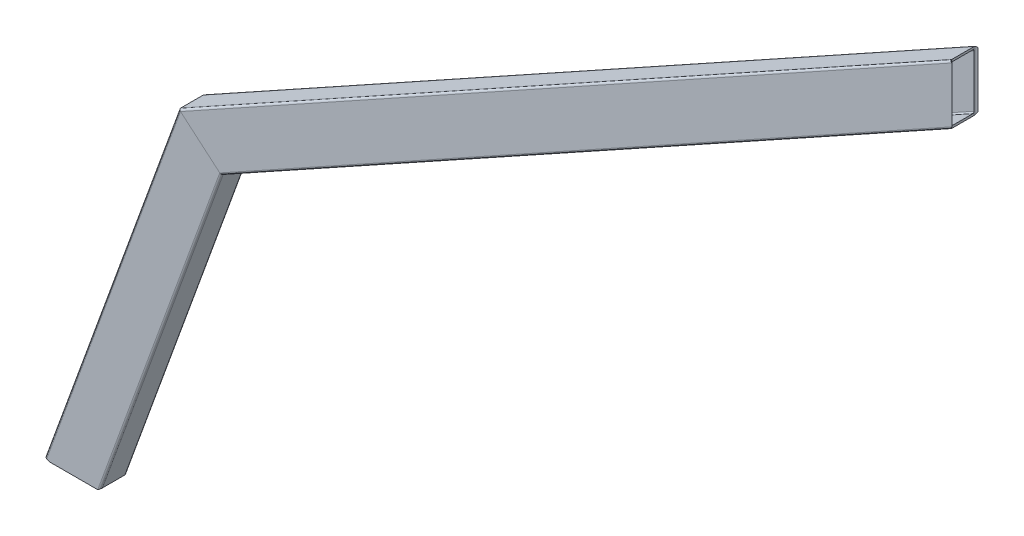
ISO-10303-21;
HEADER;
FILE_DESCRIPTION(('STEP AP214'),'2;1');
FILE_NAME('part.step','',(''),(''),'','','');
FILE_SCHEMA(('AUTOMOTIVE_DESIGN { 1 0 10303 214 1 1 1 1 }'));
ENDSEC;
DATA;
#1=APPLICATION_CONTEXT('core data for automotive mechanical design processes');
#2=APPLICATION_PROTOCOL_DEFINITION('international standard','automotive_design',2000,#1);
#3=PRODUCT_CONTEXT('',#1,'mechanical');
#4=PRODUCT('Part','Part','',(#3));
#5=PRODUCT_RELATED_PRODUCT_CATEGORY('part','',(#4));
#6=PRODUCT_DEFINITION_FORMATION('','',#4);
#7=PRODUCT_DEFINITION_CONTEXT('part definition',#1,'design');
#8=PRODUCT_DEFINITION('design','',#6,#7);
#9=PRODUCT_DEFINITION_SHAPE('','',#8);
#10=(LENGTH_UNIT() NAMED_UNIT(*) SI_UNIT(.MILLI.,.METRE.));
#11=(NAMED_UNIT(*) PLANE_ANGLE_UNIT() SI_UNIT($,.RADIAN.));
#12=(NAMED_UNIT(*) SI_UNIT($,.STERADIAN.) SOLID_ANGLE_UNIT());
#13=UNCERTAINTY_MEASURE_WITH_UNIT(LENGTH_MEASURE(1.E-05),#10,'distance_accuracy_value','');
#14=(GEOMETRIC_REPRESENTATION_CONTEXT(3) GLOBAL_UNCERTAINTY_ASSIGNED_CONTEXT((#13)) GLOBAL_UNIT_ASSIGNED_CONTEXT((#10,
#11,#12)) REPRESENTATION_CONTEXT('',''));
#15=CARTESIAN_POINT('',(0.,0.,0.));
#16=DIRECTION('',(0.,0.,1.));
#17=DIRECTION('',(1.,0.,0.));
#18=AXIS2_PLACEMENT_3D('',#15,#16,#17);
#19=CARTESIAN_POINT('',(-570.728079304435,246.926707300552,-17.0000000000489));
#20=DIRECTION('',(0.48497687865495,-0.874526973380525,0.));
#21=DIRECTION('',(0.874526973380525,0.48497687865495,0.));
#22=AXIS2_PLACEMENT_3D('',#19,#20,#21);
#23=PLANE('',#22);
#24=DIRECTION('',(0.874526973380525,0.48497687865495,0.));
#25=VECTOR('',#24,1.);
#26=CARTESIAN_POINT('',(-570.728079304435,246.926707300552,-17.0000000000489));
#27=LINE('',#26,#25);
#28=CARTESIAN_POINT('',(-557.653002268671,254.177610065125,-17.0000000000489));
#29=VERTEX_POINT('',#28);
#30=CARTESIAN_POINT('',(1.11022302462516E-13,563.429149062703,-16.9999999999999));
#31=VERTEX_POINT('',#30);
#32=EDGE_CURVE('E215',#29,#31,#27,.T.);
#33=ORIENTED_EDGE('',*,*,#32,.T.);
#34=DIRECTION('',(0.,0.,1.));
#35=VECTOR('',#34,1.);
#36=CARTESIAN_POINT('',(1.11022302462516E-13,563.429149062703,-17.0000000000489));
#37=LINE('',#36,#35);
#38=CARTESIAN_POINT('',(1.11022302462516E-13,563.429149062703,0.));
#39=VERTEX_POINT('',#38);
#40=EDGE_CURVE('E206',#31,#39,#37,.T.);
#41=ORIENTED_EDGE('',*,*,#40,.T.);
#42=DIRECTION('',(0.874526973380525,0.48497687865495,0.));
#43=VECTOR('',#42,1.);
#44=CARTESIAN_POINT('',(-570.728079304435,246.926707300552,-4.89608353859694E-11));
#45=LINE('',#44,#43);
#46=CARTESIAN_POINT('',(-557.653002268671,254.177610065125,-4.89608353859694E-11));
#47=VERTEX_POINT('',#46);
#48=EDGE_CURVE('E243',#47,#39,#45,.T.);
#49=ORIENTED_EDGE('',*,*,#48,.F.);
#50=DIRECTION('',(0.,0.,1.));
#51=VECTOR('',#50,1.);
#52=CARTESIAN_POINT('',(-557.653002268671,254.177610065125,-17.0000000000489));
#53=LINE('',#52,#51);
#54=EDGE_CURVE('E238',#29,#47,#53,.T.);
#55=ORIENTED_EDGE('',*,*,#54,.F.);
#56=EDGE_LOOP('',(#33,#41,#49,#55));
#57=FACE_BOUND('',#56,.T.);
#58=ADVANCED_FACE('F34',(#57),#23,.T.);
#59=CARTESIAN_POINT('',(-571.455544622418,248.238497760623,-17.0000000000489));
#60=DIRECTION('',(0.874526973380525,0.48497687865495,0.));
#61=DIRECTION('',(-0.48497687865495,0.874526973380525,0.));
#62=AXIS2_PLACEMENT_3D('',#59,#60,#61);
#63=CYLINDRICAL_SURFACE('',#62,1.50000000000002);
#64=DIRECTION('',(0.874526973380525,0.48497687865495,0.));
#65=VECTOR('',#64,1.);
#66=CARTESIAN_POINT('',(-571.455544622418,248.238497760623,-18.5000000000489));
#67=LINE('',#66,#65);
#68=CARTESIAN_POINT('',(-558.870782975494,255.217491671524,-18.5000000000489));
#69=VERTEX_POINT('',#68);
#70=CARTESIAN_POINT('',(1.50000000000017,565.976200652629,-18.4999999999999));
#71=VERTEX_POINT('',#70);
#72=EDGE_CURVE('E214',#69,#71,#67,.T.);
#73=ORIENTED_EDGE('',*,*,#72,.T.);
#74=CARTESIAN_POINT('',(1.50000000000017,565.976200652629,-17.0000000000244));
#75=DIRECTION('',(0.861677688772011,-0.507455969195875,0.));
#76=DIRECTION('',(0.507455969195875,0.861677688772011,0.));
#77=AXIS2_PLACEMENT_3D('',#74,#75,#76);
#78=ELLIPSE('',#77,2.95592148098473,1.50000000000001);
#79=EDGE_CURVE('E220',#71,#31,#78,.F.);
#80=ORIENTED_EDGE('',*,*,#79,.T.);
#81=ORIENTED_EDGE('',*,*,#32,.F.);
#82=CARTESIAN_POINT('',(-558.870782975494,255.217491671524,-17.0000000000489));
#83=DIRECTION('',(0.649375333167932,0.760468064203249,0.));
#84=DIRECTION('',(-0.760468064203249,0.649375333167932,0.));
#85=AXIS2_PLACEMENT_3D('',#82,#83,#84);
#86=ELLIPSE('',#85,1.60135680135299,1.50000000000002);
#87=EDGE_CURVE('E354',#69,#29,#86,.F.);
#88=ORIENTED_EDGE('',*,*,#87,.F.);
#89=EDGE_LOOP('',(#73,#80,#81,#88));
#90=FACE_BOUND('',#89,.T.);
#91=ADVANCED_FACE('F230',(#90),#63,.T.);
#92=CARTESIAN_POINT('',(-589.399689132651,280.595995775702,-17.0000000000489));
#93=DIRECTION('',(0.874526973380525,0.48497687865495,0.));
#94=DIRECTION('',(-0.48497687865495,0.874526973380525,0.));
#95=AXIS2_PLACEMENT_3D('',#92,#93,#94);
#96=CYLINDRICAL_SURFACE('',#95,1.50000000000002);
#97=DIRECTION('',(0.874526973380525,0.48497687865495,0.));
#98=VECTOR('',#97,1.);
#99=CARTESIAN_POINT('',(-590.127154450633,281.907786235773,-17.0000000000489));
#100=LINE('',#99,#98);
#101=CARTESIAN_POINT('',(-590.127154450633,281.907786235773,-17.0000000000489));
#102=VERTEX_POINT('',#101);
#103=CARTESIAN_POINT('',(1.11022302462516E-13,609.168161371698,-16.9999999999999));
#104=VERTEX_POINT('',#103);
#105=EDGE_CURVE('E234',#102,#104,#100,.T.);
#106=ORIENTED_EDGE('',*,*,#105,.T.);
#107=CARTESIAN_POINT('',(1.50000000000017,608.28478703845,-17.0000000000244));
#108=DIRECTION('',(0.507455969195875,0.861677688772011,0.));
#109=DIRECTION('',(0.861677688772011,-0.507455969195875,0.));
#110=AXIS2_PLACEMENT_3D('',#107,#108,#109);
#111=ELLIPSE('',#110,1.74079011159925,1.50000000000001);
#112=CARTESIAN_POINT('',(1.50000000000017,608.28478703845,-18.4999999999999));
#113=VERTEX_POINT('',#112);
#114=EDGE_CURVE('E251',#104,#113,#111,.F.);
#115=ORIENTED_EDGE('',*,*,#114,.T.);
#116=DIRECTION('',(0.874526973380525,0.48497687865495,0.));
#117=VECTOR('',#116,1.);
#118=CARTESIAN_POINT('',(-589.399689132651,280.595995775702,-18.5000000000489));
#119=LINE('',#118,#117);
#120=CARTESIAN_POINT('',(-588.90937374381,280.867904629374,-18.5000000000489));
#121=VERTEX_POINT('',#120);
#122=EDGE_CURVE('E291',#121,#113,#119,.T.);
#123=ORIENTED_EDGE('',*,*,#122,.F.);
#124=CARTESIAN_POINT('',(-588.90937374381,280.867904629374,-17.0000000000489));
#125=DIRECTION('',(0.649375333167932,0.760468064203249,0.));
#126=DIRECTION('',(-0.760468064203249,0.649375333167932,0.));
#127=AXIS2_PLACEMENT_3D('',#124,#125,#126);
#128=ELLIPSE('',#127,1.60135680135298,1.50000000000002);
#129=EDGE_CURVE('E359',#102,#121,#128,.F.);
#130=ORIENTED_EDGE('',*,*,#129,.F.);
#131=EDGE_LOOP('',(#106,#115,#123,#130));
#132=FACE_BOUND('',#131,.T.);
#133=ADVANCED_FACE('F414',(#132),#96,.T.);
#134=CARTESIAN_POINT('',(-590.127154450633,281.907786235773,-17.0000000000489));
#135=DIRECTION('',(-0.48497687865495,0.874526973380525,0.));
#136=DIRECTION('',(-0.874526973380525,-0.48497687865495,0.));
#137=AXIS2_PLACEMENT_3D('',#134,#135,#136);
#138=PLANE('',#137);
#139=DIRECTION('',(0.874526973380525,0.48497687865495,0.));
#140=VECTOR('',#139,1.);
#141=CARTESIAN_POINT('',(-590.127154450633,281.907786235773,-4.89608353859694E-11));
#142=LINE('',#141,#140);
#143=CARTESIAN_POINT('',(-590.127154450633,281.907786235773,-4.89608353859694E-11));
#144=VERTEX_POINT('',#143);
#145=CARTESIAN_POINT('',(1.11022302462516E-13,609.168161371698,1.11022302462516E-13));
#146=VERTEX_POINT('',#145);
#147=EDGE_CURVE('E253',#144,#146,#142,.T.);
#148=ORIENTED_EDGE('',*,*,#147,.T.);
#149=DIRECTION('',(0.,0.,-1.));
#150=VECTOR('',#149,1.);
#151=CARTESIAN_POINT('',(1.11022302462516E-13,609.168161371698,-17.0000000000489));
#152=LINE('',#151,#150);
#153=EDGE_CURVE('E50',#146,#104,#152,.T.);
#154=ORIENTED_EDGE('',*,*,#153,.T.);
#155=ORIENTED_EDGE('',*,*,#105,.F.);
#156=DIRECTION('',(0.,0.,1.));
#157=VECTOR('',#156,1.);
#158=CARTESIAN_POINT('',(-590.127154450633,281.907786235773,-17.0000000000489));
#159=LINE('',#158,#157);
#160=EDGE_CURVE('E256',#102,#144,#159,.T.);
#161=ORIENTED_EDGE('',*,*,#160,.T.);
#162=EDGE_LOOP('',(#148,#154,#155,#161));
#163=FACE_BOUND('',#162,.T.);
#164=ADVANCED_FACE('F438',(#163),#138,.T.);
#165=CARTESIAN_POINT('',(-589.399689132651,280.595995775702,-4.89053242347381E-11));
#166=DIRECTION('',(0.874526973380525,0.48497687865495,0.));
#167=DIRECTION('',(-0.48497687865495,0.874526973380525,0.));
#168=AXIS2_PLACEMENT_3D('',#165,#166,#167);
#169=CYLINDRICAL_SURFACE('',#168,1.50000000000002);
#170=DIRECTION('',(0.874526973380525,0.48497687865495,0.));
#171=VECTOR('',#170,1.);
#172=CARTESIAN_POINT('',(-589.399689132651,280.595995775702,1.4999999999511));
#173=LINE('',#172,#171);
#174=CARTESIAN_POINT('',(-588.90937374381,280.867904629374,1.4999999999511));
#175=VERTEX_POINT('',#174);
#176=CARTESIAN_POINT('',(1.50000000000017,608.28478703845,1.50000000000011));
#177=VERTEX_POINT('',#176);
#178=EDGE_CURVE('E282',#175,#177,#173,.T.);
#179=ORIENTED_EDGE('',*,*,#178,.T.);
#180=CARTESIAN_POINT('',(1.50000000000017,608.28478703845,-2.44249065417534E-11));
#181=DIRECTION('',(0.507455969195875,0.861677688772011,0.));
#182=DIRECTION('',(0.861677688772011,-0.507455969195875,0.));
#183=AXIS2_PLACEMENT_3D('',#180,#181,#182);
#184=ELLIPSE('',#183,1.74079011159925,1.50000000000001);
#185=EDGE_CURVE('E279',#177,#146,#184,.F.);
#186=ORIENTED_EDGE('',*,*,#185,.T.);
#187=ORIENTED_EDGE('',*,*,#147,.F.);
#188=CARTESIAN_POINT('',(-588.90937374381,280.867904629374,-4.89053242347381E-11));
#189=DIRECTION('',(0.649375333167932,0.760468064203249,0.));
#190=DIRECTION('',(-0.760468064203249,0.649375333167932,0.));
#191=AXIS2_PLACEMENT_3D('',#188,#189,#190);
#192=ELLIPSE('',#191,1.60135680135298,1.50000000000002);
#193=EDGE_CURVE('E368',#175,#144,#192,.F.);
#194=ORIENTED_EDGE('',*,*,#193,.F.);
#195=EDGE_LOOP('',(#179,#186,#187,#194));
#196=FACE_BOUND('',#195,.T.);
#197=ADVANCED_FACE('F440',(#196),#169,.T.);
#198=CARTESIAN_POINT('',(-571.455544622418,248.238497760623,1.4999999999511));
#199=DIRECTION('',(0.,0.,1.));
#200=DIRECTION('',(0.,-1.,0.));
#201=AXIS2_PLACEMENT_3D('',#198,#199,#200);
#202=PLANE('',#201);
#203=DIRECTION('',(0.874526973380525,0.48497687865495,0.));
#204=VECTOR('',#203,1.);
#205=CARTESIAN_POINT('',(-571.455544622418,248.238497760623,1.4999999999511));
#206=LINE('',#205,#204);
#207=CARTESIAN_POINT('',(-558.870782975494,255.217491671524,1.4999999999511));
#208=VERTEX_POINT('',#207);
#209=CARTESIAN_POINT('',(1.50000000000006,565.976200652629,1.4999999999511));
#210=VERTEX_POINT('',#209);
#211=EDGE_CURVE('E246',#208,#210,#206,.T.);
#212=ORIENTED_EDGE('',*,*,#211,.T.);
#213=DIRECTION('',(0.,-1.,0.));
#214=VECTOR('',#213,1.);
#215=CARTESIAN_POINT('',(1.50000000000017,862.501,1.50000000000017));
#216=LINE('',#215,#214);
#217=EDGE_CURVE('E285',#177,#210,#216,.T.);
#218=ORIENTED_EDGE('',*,*,#217,.F.);
#219=ORIENTED_EDGE('',*,*,#178,.F.);
#220=DIRECTION('',(-0.760468064203249,0.649375333167932,0.));
#221=VECTOR('',#220,1.);
#222=CARTESIAN_POINT('',(-482.826242078167,190.281892919535,1.4999999999511));
#223=LINE('',#222,#221);
#224=EDGE_CURVE('E389',#208,#175,#223,.T.);
#225=ORIENTED_EDGE('',*,*,#224,.F.);
#226=EDGE_LOOP('',(#212,#218,#219,#225));
#227=FACE_BOUND('',#226,.T.);
#228=ADVANCED_FACE('F581',(#227),#202,.T.);
#229=CARTESIAN_POINT('',(-571.455544622418,248.238497760623,-4.89053242347381E-11));
#230=DIRECTION('',(0.874526973380525,0.48497687865495,0.));
#231=DIRECTION('',(-0.48497687865495,0.874526973380525,0.));
#232=AXIS2_PLACEMENT_3D('',#229,#230,#231);
#233=CYLINDRICAL_SURFACE('',#232,1.50000000000002);
#234=ORIENTED_EDGE('',*,*,#48,.T.);
#235=CARTESIAN_POINT('',(1.50000000000017,565.976200652629,-2.44249065417534E-11));
#236=DIRECTION('',(0.861677688772011,-0.507455969195875,0.));
#237=DIRECTION('',(0.507455969195875,0.861677688772011,0.));
#238=AXIS2_PLACEMENT_3D('',#235,#236,#237);
#239=ELLIPSE('',#238,2.95592148098472,1.50000000000001);
#240=EDGE_CURVE('E245',#39,#210,#239,.F.);
#241=ORIENTED_EDGE('',*,*,#240,.T.);
#242=ORIENTED_EDGE('',*,*,#211,.F.);
#243=CARTESIAN_POINT('',(-558.870782975494,255.217491671524,-4.89053242347381E-11));
#244=DIRECTION('',(0.649375333167932,0.760468064203249,0.));
#245=DIRECTION('',(-0.760468064203249,0.649375333167932,0.));
#246=AXIS2_PLACEMENT_3D('',#243,#244,#245);
#247=ELLIPSE('',#246,1.60135680135298,1.50000000000002);
#248=EDGE_CURVE('E339',#47,#208,#247,.F.);
#249=ORIENTED_EDGE('',*,*,#248,.F.);
#250=EDGE_LOOP('',(#234,#241,#242,#249));
#251=FACE_BOUND('',#250,.T.);
#252=ADVANCED_FACE('F586',(#251),#233,.T.);
#253=CARTESIAN_POINT('',(-588.914712253996,279.721468802322,-1.00000000004891));
#254=DIRECTION('',(0.874526973380525,0.48497687865495,0.));
#255=DIRECTION('',(-0.48497687865495,0.874526973380525,0.));
#256=AXIS2_PLACEMENT_3D('',#253,#254,#255);
#257=CYLINDRICAL_SURFACE('',#256,0.999999999999976);
#258=DIRECTION('',(0.874526973380525,0.48497687865495,0.));
#259=VECTOR('',#258,1.);
#260=CARTESIAN_POINT('',(-589.399689132651,280.595995775702,-1.00000000004891));
#261=LINE('',#260,#259);
#262=CARTESIAN_POINT('',(-588.90937374381,280.867904629374,-1.00000000004891));
#263=VERTEX_POINT('',#262);
#264=CARTESIAN_POINT('',(1.11022302462516E-13,607.452948410111,-1.00000000004891));
#265=VERTEX_POINT('',#264);
#266=EDGE_CURVE('E261',#263,#265,#261,.T.);
#267=ORIENTED_EDGE('',*,*,#266,.T.);
#268=CARTESIAN_POINT('',(1.11022302462516E-13,606.309473102386,-1.00000000004891));
#269=DIRECTION('',(1.,0.,0.));
#270=DIRECTION('',(0.,1.,0.));
#271=AXIS2_PLACEMENT_3D('',#268,#269,#270);
#272=ELLIPSE('',#271,1.14347530772485,0.999999999999976);
#273=CARTESIAN_POINT('',(1.11022302462516E-13,606.309473102386,1.11022302462516E-13));
#274=VERTEX_POINT('',#273);
#275=EDGE_CURVE('E257',#265,#274,#272,.T.);
#276=ORIENTED_EDGE('',*,*,#275,.T.);
#277=DIRECTION('',(0.874526973380525,0.48497687865495,0.));
#278=VECTOR('',#277,1.);
#279=CARTESIAN_POINT('',(-588.914712253996,279.721468802322,-4.89053242347381E-11));
#280=LINE('',#279,#278);
#281=CARTESIAN_POINT('',(-588.097519939261,280.174650225108,-4.89053242347381E-11));
#282=VERTEX_POINT('',#281);
#283=EDGE_CURVE('E278',#282,#274,#280,.T.);
#284=ORIENTED_EDGE('',*,*,#283,.F.);
#285=CARTESIAN_POINT('',(-588.097519939261,280.174650225108,-1.00000000004891));
#286=DIRECTION('',(0.649375333167932,0.760468064203249,0.));
#287=DIRECTION('',(-0.760468064203249,0.649375333167932,0.));
#288=AXIS2_PLACEMENT_3D('',#285,#286,#287);
#289=ELLIPSE('',#288,1.06757120090195,0.999999999999976);
#290=EDGE_CURVE('E336',#263,#282,#289,.T.);
#291=ORIENTED_EDGE('',*,*,#290,.F.);
#292=EDGE_LOOP('',(#267,#276,#284,#291));
#293=FACE_BOUND('',#292,.T.);
#294=ADVANCED_FACE('F526',(#293),#257,.F.);
#295=CARTESIAN_POINT('',(-589.399689132651,280.595995775702,-16.0000000000489));
#296=DIRECTION('',(0.48497687865495,-0.874526973380525,0.));
#297=DIRECTION('',(0.874526973380525,0.48497687865495,0.));
#298=AXIS2_PLACEMENT_3D('',#295,#296,#297);
#299=PLANE('',#298);
#300=DIRECTION('',(0.874526973380525,0.48497687865495,0.));
#301=VECTOR('',#300,1.);
#302=CARTESIAN_POINT('',(-589.399689132651,280.595995775702,-16.0000000000489));
#303=LINE('',#302,#301);
#304=CARTESIAN_POINT('',(-588.90937374381,280.867904629374,-16.0000000000489));
#305=VERTEX_POINT('',#304);
#306=CARTESIAN_POINT('',(1.11022302462516E-13,607.452948410111,-16.0000000000489));
#307=VERTEX_POINT('',#306);
#308=EDGE_CURVE('E260',#305,#307,#303,.T.);
#309=ORIENTED_EDGE('',*,*,#308,.T.);
#310=DIRECTION('',(0.,0.,1.));
#311=VECTOR('',#310,1.);
#312=CARTESIAN_POINT('',(1.11022302462516E-13,607.452948410111,-16.0000000000489));
#313=LINE('',#312,#311);
#314=EDGE_CURVE('E262',#307,#265,#313,.T.);
#315=ORIENTED_EDGE('',*,*,#314,.T.);
#316=ORIENTED_EDGE('',*,*,#266,.F.);
#317=DIRECTION('',(0.,0.,1.));
#318=VECTOR('',#317,1.);
#319=CARTESIAN_POINT('',(-588.90937374381,280.867904629374,-16.0000000000489));
#320=LINE('',#319,#318);
#321=EDGE_CURVE('E337',#305,#263,#320,.T.);
#322=ORIENTED_EDGE('',*,*,#321,.F.);
#323=EDGE_LOOP('',(#309,#315,#316,#322));
#324=FACE_BOUND('',#323,.T.);
#325=ADVANCED_FACE('F540',(#324),#299,.T.);
#326=CARTESIAN_POINT('',(-588.914712253996,279.721468802322,-16.0000000000489));
#327=DIRECTION('',(0.874526973380525,0.48497687865495,0.));
#328=DIRECTION('',(-0.48497687865495,0.874526973380525,0.));
#329=AXIS2_PLACEMENT_3D('',#326,#327,#328);
#330=CYLINDRICAL_SURFACE('',#329,0.999999999999973);
#331=DIRECTION('',(0.874526973380525,0.48497687865495,0.));
#332=VECTOR('',#331,1.);
#333=CARTESIAN_POINT('',(-588.914712253996,279.721468802322,-17.0000000000489));
#334=LINE('',#333,#332);
#335=CARTESIAN_POINT('',(-588.097519939261,280.174650225108,-17.0000000000489));
#336=VERTEX_POINT('',#335);
#337=CARTESIAN_POINT('',(1.11022302462516E-13,606.309473102386,-16.9999999999999));
#338=VERTEX_POINT('',#337);
#339=EDGE_CURVE('E265',#336,#338,#334,.T.);
#340=ORIENTED_EDGE('',*,*,#339,.T.);
#341=CARTESIAN_POINT('',(1.11022302462516E-13,606.309473102386,-16.0000000000489));
#342=DIRECTION('',(1.,0.,0.));
#343=DIRECTION('',(0.,1.,0.));
#344=AXIS2_PLACEMENT_3D('',#341,#342,#343);
#345=ELLIPSE('',#344,1.14347530772484,0.999999999999973);
#346=EDGE_CURVE('E57',#338,#307,#345,.T.);
#347=ORIENTED_EDGE('',*,*,#346,.T.);
#348=ORIENTED_EDGE('',*,*,#308,.F.);
#349=CARTESIAN_POINT('',(-588.097519939261,280.174650225108,-16.0000000000489));
#350=DIRECTION('',(0.649375333167932,0.760468064203249,0.));
#351=DIRECTION('',(-0.760468064203249,0.649375333167932,0.));
#352=AXIS2_PLACEMENT_3D('',#349,#350,#351);
#353=ELLIPSE('',#352,1.06757120090195,0.999999999999973);
#354=EDGE_CURVE('E342',#336,#305,#353,.T.);
#355=ORIENTED_EDGE('',*,*,#354,.F.);
#356=EDGE_LOOP('',(#340,#347,#348,#355));
#357=FACE_BOUND('',#356,.T.);
#358=ADVANCED_FACE('F543',(#357),#330,.F.);
#359=CARTESIAN_POINT('',(-571.940521501073,249.113024734003,-17.0000000000489));
#360=DIRECTION('',(0.,0.,1.));
#361=DIRECTION('',(0.,-1.,0.));
#362=AXIS2_PLACEMENT_3D('',#359,#360,#361);
#363=PLANE('',#362);
#364=DIRECTION('',(0.874526973380525,0.48497687865495,0.));
#365=VECTOR('',#364,1.);
#366=CARTESIAN_POINT('',(-571.940521501073,249.113024734003,-17.0000000000489));
#367=LINE('',#366,#365);
#368=CARTESIAN_POINT('',(-559.682636780043,255.91074607579,-17.0000000000489));
#369=VERTEX_POINT('',#368);
#370=CARTESIAN_POINT('',(1.11022302462516E-13,566.287837332015,-17.0000000000489));
#371=VERTEX_POINT('',#370);
#372=EDGE_CURVE('E267',#369,#371,#367,.T.);
#373=ORIENTED_EDGE('',*,*,#372,.T.);
#374=DIRECTION('',(0.,-1.,0.));
#375=VECTOR('',#374,1.);
#376=CARTESIAN_POINT('',(1.11022302462516E-13,862.501,-16.9999999999998));
#377=LINE('',#376,#375);
#378=EDGE_CURVE('E223',#338,#371,#377,.T.);
#379=ORIENTED_EDGE('',*,*,#378,.F.);
#380=ORIENTED_EDGE('',*,*,#339,.F.);
#381=DIRECTION('',(-0.760468064203249,0.649375333167932,0.));
#382=VECTOR('',#381,1.);
#383=CARTESIAN_POINT('',(-483.538576827888,190.890166477888,-17.0000000000489));
#384=LINE('',#383,#382);
#385=EDGE_CURVE('E292',#369,#336,#384,.T.);
#386=ORIENTED_EDGE('',*,*,#385,.F.);
#387=EDGE_LOOP('',(#373,#379,#380,#386));
#388=FACE_BOUND('',#387,.T.);
#389=ADVANCED_FACE('F555',(#388),#363,.T.);
#390=CARTESIAN_POINT('',(-571.940521501073,249.113024734003,-16.0000000000489));
#391=DIRECTION('',(0.874526973380525,0.48497687865495,0.));
#392=DIRECTION('',(-0.48497687865495,0.874526973380525,0.));
#393=AXIS2_PLACEMENT_3D('',#390,#391,#392);
#394=CYLINDRICAL_SURFACE('',#393,1.00000000000003);
#395=DIRECTION('',(0.874526973380525,0.48497687865495,0.));
#396=VECTOR('',#395,1.);
#397=CARTESIAN_POINT('',(-571.455544622418,248.238497760623,-16.0000000000489));
#398=LINE('',#397,#396);
#399=CARTESIAN_POINT('',(-558.870782975494,255.217491671524,-16.0000000000489));
#400=VERTEX_POINT('',#399);
#401=CARTESIAN_POINT('',(1.11022302462516E-13,565.14436202429,-16.0000000000489));
#402=VERTEX_POINT('',#401);
#403=EDGE_CURVE('E271',#400,#402,#398,.T.);
#404=ORIENTED_EDGE('',*,*,#403,.T.);
#405=CARTESIAN_POINT('',(1.11022302462516E-13,566.287837332015,-16.0000000000489));
#406=DIRECTION('',(1.,0.,0.));
#407=DIRECTION('',(0.,1.,0.));
#408=AXIS2_PLACEMENT_3D('',#405,#406,#407);
#409=ELLIPSE('',#408,1.14347530772491,1.00000000000003);
#410=EDGE_CURVE('E268',#402,#371,#409,.T.);
#411=ORIENTED_EDGE('',*,*,#410,.T.);
#412=ORIENTED_EDGE('',*,*,#372,.F.);
#413=CARTESIAN_POINT('',(-559.682636780043,255.91074607579,-16.0000000000489));
#414=DIRECTION('',(0.649375333167932,0.760468064203249,0.));
#415=DIRECTION('',(-0.760468064203249,0.649375333167932,0.));
#416=AXIS2_PLACEMENT_3D('',#413,#414,#415);
#417=ELLIPSE('',#416,1.06757120090201,1.00000000000003);
#418=EDGE_CURVE('E345',#400,#369,#417,.T.);
#419=ORIENTED_EDGE('',*,*,#418,.F.);
#420=EDGE_LOOP('',(#404,#411,#412,#419));
#421=FACE_BOUND('',#420,.T.);
#422=ADVANCED_FACE('F557',(#421),#394,.F.);
#423=CARTESIAN_POINT('',(-571.455544622418,248.238497760623,-16.0000000000489));
#424=DIRECTION('',(-0.48497687865495,0.874526973380525,0.));
#425=DIRECTION('',(-0.874526973380525,-0.48497687865495,0.));
#426=AXIS2_PLACEMENT_3D('',#423,#424,#425);
#427=PLANE('',#426);
#428=DIRECTION('',(0.874526973380525,0.48497687865495,0.));
#429=VECTOR('',#428,1.);
#430=CARTESIAN_POINT('',(-571.455544622418,248.238497760623,-1.00000000004891));
#431=LINE('',#430,#429);
#432=CARTESIAN_POINT('',(-558.870782975494,255.217491671524,-1.00000000004891));
#433=VERTEX_POINT('',#432);
#434=CARTESIAN_POINT('',(1.11022302462516E-13,565.14436202429,-1.00000000004891));
#435=VERTEX_POINT('',#434);
#436=EDGE_CURVE('E270',#433,#435,#431,.T.);
#437=ORIENTED_EDGE('',*,*,#436,.T.);
#438=DIRECTION('',(0.,0.,-1.));
#439=VECTOR('',#438,1.);
#440=CARTESIAN_POINT('',(1.11022302462516E-13,565.14436202429,-16.0000000000489));
#441=LINE('',#440,#439);
#442=EDGE_CURVE('E272',#435,#402,#441,.T.);
#443=ORIENTED_EDGE('',*,*,#442,.T.);
#444=ORIENTED_EDGE('',*,*,#403,.F.);
#445=DIRECTION('',(0.,0.,-1.));
#446=VECTOR('',#445,1.);
#447=CARTESIAN_POINT('',(-558.870782975494,255.217491671524,-16.0000000000489));
#448=LINE('',#447,#446);
#449=EDGE_CURVE('E309',#433,#400,#448,.T.);
#450=ORIENTED_EDGE('',*,*,#449,.F.);
#451=EDGE_LOOP('',(#437,#443,#444,#450));
#452=FACE_BOUND('',#451,.T.);
#453=ADVANCED_FACE('F306',(#452),#427,.T.);
#454=CARTESIAN_POINT('',(-571.940521501073,249.113024734003,-1.00000000004891));
#455=DIRECTION('',(0.874526973380525,0.48497687865495,0.));
#456=DIRECTION('',(-0.48497687865495,0.874526973380525,0.));
#457=AXIS2_PLACEMENT_3D('',#454,#455,#456);
#458=CYLINDRICAL_SURFACE('',#457,1.00000000000003);
#459=DIRECTION('',(0.874526973380525,0.48497687865495,0.));
#460=VECTOR('',#459,1.);
#461=CARTESIAN_POINT('',(-571.940521501073,249.113024734003,-4.89053242347381E-11));
#462=LINE('',#461,#460);
#463=CARTESIAN_POINT('',(-559.682636780043,255.91074607579,-4.89053242347381E-11));
#464=VERTEX_POINT('',#463);
#465=CARTESIAN_POINT('',(2.22044604925031E-13,566.287837332015,-4.89053242347381E-11));
#466=VERTEX_POINT('',#465);
#467=EDGE_CURVE('E37',#464,#466,#462,.T.);
#468=ORIENTED_EDGE('',*,*,#467,.T.);
#469=CARTESIAN_POINT('',(1.11022302462516E-13,566.287837332015,-1.00000000004891));
#470=DIRECTION('',(1.,0.,0.));
#471=DIRECTION('',(0.,1.,0.));
#472=AXIS2_PLACEMENT_3D('',#469,#470,#471);
#473=ELLIPSE('',#472,1.14347530772491,1.00000000000003);
#474=EDGE_CURVE('E275',#466,#435,#473,.T.);
#475=ORIENTED_EDGE('',*,*,#474,.T.);
#476=ORIENTED_EDGE('',*,*,#436,.F.);
#477=CARTESIAN_POINT('',(-559.682636780043,255.91074607579,-1.00000000004891));
#478=DIRECTION('',(0.649375333167932,0.760468064203249,0.));
#479=DIRECTION('',(-0.760468064203249,0.649375333167932,0.));
#480=AXIS2_PLACEMENT_3D('',#477,#478,#479);
#481=ELLIPSE('',#480,1.06757120090201,1.00000000000003);
#482=EDGE_CURVE('E315',#464,#433,#481,.T.);
#483=ORIENTED_EDGE('',*,*,#482,.F.);
#484=EDGE_LOOP('',(#468,#475,#476,#483));
#485=FACE_BOUND('',#484,.T.);
#486=ADVANCED_FACE('F314',(#485),#458,.F.);
#487=CARTESIAN_POINT('',(-571.940521501073,249.113024734003,-4.89053242347381E-11));
#488=DIRECTION('',(0.,0.,-1.));
#489=DIRECTION('',(0.,1.,0.));
#490=AXIS2_PLACEMENT_3D('',#487,#488,#489);
#491=PLANE('',#490);
#492=ORIENTED_EDGE('',*,*,#283,.T.);
#493=DIRECTION('',(0.,-1.,0.));
#494=VECTOR('',#493,1.);
#495=CARTESIAN_POINT('',(1.11022302462516E-13,862.501,-4.89053242347381E-11));
#496=LINE('',#495,#494);
#497=EDGE_CURVE('E82',#274,#466,#496,.T.);
#498=ORIENTED_EDGE('',*,*,#497,.T.);
#499=ORIENTED_EDGE('',*,*,#467,.F.);
#500=DIRECTION('',(0.760468064203249,-0.649375333167932,0.));
#501=VECTOR('',#500,1.);
#502=CARTESIAN_POINT('',(-483.538576827888,190.890166477888,-4.89053242347381E-11));
#503=LINE('',#502,#501);
#504=EDGE_CURVE('E326',#282,#464,#503,.T.);
#505=ORIENTED_EDGE('',*,*,#504,.F.);
#506=EDGE_LOOP('',(#492,#498,#499,#505));
#507=FACE_BOUND('',#506,.T.);
#508=ADVANCED_FACE('F521',(#507),#491,.T.);
#509=CARTESIAN_POINT('',(-656.555031548075,-13.1677755180381,1.4999999999511));
#510=DIRECTION('',(0.,0.,1.));
#511=DIRECTION('',(1.,0.,0.));
#512=AXIS2_PLACEMENT_3D('',#509,#510,#511);
#513=PLANE('',#512);
#514=DIRECTION('',(0.93969262078591,-0.342020143325663,0.));
#515=VECTOR('',#514,1.);
#516=CARTESIAN_POINT('',(-656.555031548075,-13.1677755180381,1.4999999999511));
#517=LINE('',#516,#515);
#518=CARTESIAN_POINT('',(-691.323658517153,-0.513030214988539,1.4999999999511));
#519=VERTEX_POINT('',#518);
#520=CARTESIAN_POINT('',(-688.61198131915,-1.50000000000004,1.49999999995104));
#521=VERTEX_POINT('',#520);
#522=EDGE_CURVE('E369',#519,#521,#517,.T.);
#523=ORIENTED_EDGE('',*,*,#522,.T.);
#524=DIRECTION('',(1.,0.,0.));
#525=VECTOR('',#524,1.);
#526=CARTESIAN_POINT('',(-692.733197448332,-1.50000000000004,1.49999999995104));
#527=LINE('',#526,#525);
#528=CARTESIAN_POINT('',(-652.308308559409,-1.50000000000004,1.49999999995104));
#529=VERTEX_POINT('',#528);
#530=EDGE_CURVE('E372',#521,#529,#527,.T.);
#531=ORIENTED_EDGE('',*,*,#530,.T.);
#532=DIRECTION('',(0.342020143325663,0.93969262078591,0.));
#533=VECTOR('',#532,1.);
#534=CARTESIAN_POINT('',(-656.555031548075,-13.1677755180381,1.4999999999511));
#535=LINE('',#534,#533);
#536=EDGE_CURVE('E393',#529,#208,#535,.T.);
#537=ORIENTED_EDGE('',*,*,#536,.T.);
#538=ORIENTED_EDGE('',*,*,#224,.T.);
#539=DIRECTION('',(0.342020143325663,0.93969262078591,0.));
#540=VECTOR('',#539,1.);
#541=CARTESIAN_POINT('',(-691.323658517153,-0.513030214988539,1.4999999999511));
#542=LINE('',#541,#540);
#543=EDGE_CURVE('E358',#519,#175,#542,.T.);
#544=ORIENTED_EDGE('',*,*,#543,.F.);
#545=EDGE_LOOP('',(#523,#531,#537,#538,#544));
#546=FACE_BOUND('',#545,.T.);
#547=ADVANCED_FACE('F448',(#546),#513,.T.);
#548=CARTESIAN_POINT('',(-656.555031548075,-13.1677755180381,-4.89053242347381E-11));
#549=DIRECTION('',(-0.342020143325663,-0.93969262078591,0.));
#550=DIRECTION('',(0.93969262078591,-0.342020143325663,0.));
#551=AXIS2_PLACEMENT_3D('',#548,#549,#550);
#552=PLANE('',#551);
#553=CARTESIAN_POINT('',(-688.61198131915,-1.50000000000004,-17.000000000049));
#554=DIRECTION('',(-0.342020143325663,-0.93969262078591,0.));
#555=DIRECTION('',(0.93969262078591,-0.342020143325663,0.));
#556=AXIS2_PLACEMENT_3D('',#553,#554,#555);
#557=ELLIPSE('',#556,4.38570660024471,1.5);
#558=CARTESIAN_POINT('',(-692.733197448332,0.,-17.000000000049));
#559=VERTEX_POINT('',#558);
#560=CARTESIAN_POINT('',(-688.61198131915,-1.50000000000003,-18.500000000049));
#561=VERTEX_POINT('',#560);
#562=EDGE_CURVE('E430',#559,#561,#557,.T.);
#563=ORIENTED_EDGE('',*,*,#562,.F.);
#564=CARTESIAN_POINT('',(-691.323658517153,-0.513030214988539,-17.0000000000489));
#565=DIRECTION('',(0.342020143325663,0.93969262078591,0.));
#566=DIRECTION('',(-0.93969262078591,0.342020143325663,0.));
#567=AXIS2_PLACEMENT_3D('',#564,#565,#566);
#568=CIRCLE('',#567,1.50000000000002);
#569=CARTESIAN_POINT('',(-691.323658517153,-0.513030214988539,-18.5000000000489));
#570=VERTEX_POINT('',#569);
#571=EDGE_CURVE('E355',#570,#559,#568,.T.);
#572=ORIENTED_EDGE('',*,*,#571,.F.);
#573=DIRECTION('',(-0.93969262078591,0.342020143325663,0.));
#574=VECTOR('',#573,1.);
#575=CARTESIAN_POINT('',(-656.555031548075,-13.1677755180381,-18.5000000000489));
#576=LINE('',#575,#574);
#577=EDGE_CURVE('E351',#561,#570,#576,.T.);
#578=ORIENTED_EDGE('',*,*,#577,.F.);
#579=EDGE_LOOP('',(#563,#572,#578));
#580=FACE_BOUND('',#579,.T.);
#581=ADVANCED_FACE('F429',(#580),#552,.T.);
#582=CARTESIAN_POINT('',(-657.494724168861,-12.8257553747124,-17.0000000000489));
#583=DIRECTION('',(0.,0.,1.));
#584=DIRECTION('',(1.,0.,0.));
#585=AXIS2_PLACEMENT_3D('',#582,#583,#584);
#586=PLANE('',#585);
#587=DIRECTION('',(1.,0.,0.));
#588=VECTOR('',#587,1.);
#589=CARTESIAN_POINT('',(-692.733197448332,0.,-17.000000000049));
#590=LINE('',#589,#588);
#591=CARTESIAN_POINT('',(-690.072753017143,0.,-17.0000000000489));
#592=VERTEX_POINT('',#591);
#593=CARTESIAN_POINT('',(-652.826530980486,0.,-17.000000000049));
#594=VERTEX_POINT('',#593);
#595=EDGE_CURVE('E392',#592,#594,#590,.T.);
#596=ORIENTED_EDGE('',*,*,#595,.T.);
#597=DIRECTION('',(0.342020143325663,0.93969262078591,0.));
#598=VECTOR('',#597,1.);
#599=CARTESIAN_POINT('',(-657.494724168861,-12.8257553747124,-17.0000000000489));
#600=LINE('',#599,#598);
#601=EDGE_CURVE('E477',#594,#369,#600,.T.);
#602=ORIENTED_EDGE('',*,*,#601,.T.);
#603=ORIENTED_EDGE('',*,*,#385,.T.);
#604=DIRECTION('',(0.342020143325663,0.93969262078591,0.));
#605=VECTOR('',#604,1.);
#606=CARTESIAN_POINT('',(-690.383965896367,-0.855050358314194,-17.0000000000489));
#607=LINE('',#606,#605);
#608=EDGE_CURVE('E343',#592,#336,#607,.T.);
#609=ORIENTED_EDGE('',*,*,#608,.F.);
#610=EDGE_LOOP('',(#596,#602,#603,#609));
#611=FACE_BOUND('',#610,.T.);
#612=ADVANCED_FACE('F551',(#611),#586,.T.);
#613=CARTESIAN_POINT('',(-571.455544622418,248.238497760623,-18.5000000000489));
#614=DIRECTION('',(0.,0.,-1.));
#615=DIRECTION('',(0.,1.,0.));
#616=AXIS2_PLACEMENT_3D('',#613,#614,#615);
#617=PLANE('',#616);
#618=DIRECTION('',(0.,-1.,0.));
#619=VECTOR('',#618,1.);
#620=CARTESIAN_POINT('',(1.50000000000017,862.501,-18.4999999999999));
#621=LINE('',#620,#619);
#622=EDGE_CURVE('E289',#113,#71,#621,.T.);
#623=ORIENTED_EDGE('',*,*,#622,.T.);
#624=ORIENTED_EDGE('',*,*,#72,.F.);
#625=DIRECTION('',(0.760468064203249,-0.649375333167932,0.));
#626=VECTOR('',#625,1.);
#627=CARTESIAN_POINT('',(-482.826242078167,190.281892919535,-18.5000000000489));
#628=LINE('',#627,#626);
#629=EDGE_CURVE('E379',#121,#69,#628,.T.);
#630=ORIENTED_EDGE('',*,*,#629,.F.);
#631=ORIENTED_EDGE('',*,*,#122,.T.);
#632=EDGE_LOOP('',(#623,#624,#630,#631));
#633=FACE_BOUND('',#632,.T.);
#634=ADVANCED_FACE('F412',(#633),#617,.T.);
#635=CARTESIAN_POINT('',(-692.733197448332,0.,-17.0000000000489));
#636=DIRECTION('',(-0.93969262078591,0.342020143325663,0.));
#637=DIRECTION('',(-0.342020143325663,-0.93969262078591,0.));
#638=AXIS2_PLACEMENT_3D('',#635,#636,#637);
#639=PLANE('',#638);
#640=DIRECTION('',(0.342020143325663,0.93969262078591,0.));
#641=VECTOR('',#640,1.);
#642=CARTESIAN_POINT('',(-692.733197448332,0.,-4.89608353859694E-11));
#643=LINE('',#642,#641);
#644=CARTESIAN_POINT('',(-692.733197448332,0.,-4.89608353859694E-11));
#645=VERTEX_POINT('',#644);
#646=EDGE_CURVE('E364',#645,#144,#643,.T.);
#647=ORIENTED_EDGE('',*,*,#646,.T.);
#648=ORIENTED_EDGE('',*,*,#160,.F.);
#649=DIRECTION('',(0.342020143325663,0.93969262078591,0.));
#650=VECTOR('',#649,1.);
#651=CARTESIAN_POINT('',(-692.733197448332,0.,-17.0000000000489));
#652=LINE('',#651,#650);
#653=EDGE_CURVE('E376',#559,#102,#652,.T.);
#654=ORIENTED_EDGE('',*,*,#653,.F.);
#655=DIRECTION('',(0.,0.,1.));
#656=VECTOR('',#655,1.);
#657=CARTESIAN_POINT('',(-692.733197448332,0.,-17.0000000000489));
#658=LINE('',#657,#656);
#659=EDGE_CURVE('E360',#559,#645,#658,.T.);
#660=ORIENTED_EDGE('',*,*,#659,.T.);
#661=EDGE_LOOP('',(#647,#648,#654,#660));
#662=FACE_BOUND('',#661,.T.);
#663=ADVANCED_FACE('F433',(#662),#639,.T.);
#664=CARTESIAN_POINT('',(-655.145492616896,-13.6808057330266,-17.0000000000489));
#665=DIRECTION('',(0.93969262078591,-0.342020143325663,0.));
#666=DIRECTION('',(0.342020143325663,0.93969262078591,0.));
#667=AXIS2_PLACEMENT_3D('',#664,#665,#666);
#668=PLANE('',#667);
#669=DIRECTION('',(0.,0.,1.));
#670=VECTOR('',#669,1.);
#671=CARTESIAN_POINT('',(-650.166086549296,0.,-17.0000000000489));
#672=LINE('',#671,#670);
#673=CARTESIAN_POINT('',(-650.166086549296,0.,-17.000000000049));
#674=VERTEX_POINT('',#673);
#675=CARTESIAN_POINT('',(-650.166086549296,0.,-4.89608353859694E-11));
#676=VERTEX_POINT('',#675);
#677=EDGE_CURVE('E466',#674,#676,#672,.T.);
#678=ORIENTED_EDGE('',*,*,#677,.F.);
#679=DIRECTION('',(0.342020143325663,0.93969262078591,0.));
#680=VECTOR('',#679,1.);
#681=CARTESIAN_POINT('',(-655.145492616896,-13.6808057330266,-17.0000000000489));
#682=LINE('',#681,#680);
#683=EDGE_CURVE('E363',#674,#29,#682,.T.);
#684=ORIENTED_EDGE('',*,*,#683,.T.);
#685=ORIENTED_EDGE('',*,*,#54,.T.);
#686=DIRECTION('',(0.342020143325663,0.93969262078591,0.));
#687=VECTOR('',#686,1.);
#688=CARTESIAN_POINT('',(-655.145492616896,-13.6808057330266,-4.89608353859694E-11));
#689=LINE('',#688,#687);
#690=EDGE_CURVE('E367',#676,#47,#689,.T.);
#691=ORIENTED_EDGE('',*,*,#690,.F.);
#692=EDGE_LOOP('',(#678,#684,#685,#691));
#693=FACE_BOUND('',#692,.T.);
#694=ADVANCED_FACE('F517',(#693),#668,.T.);
#695=CARTESIAN_POINT('',(-656.555031548075,-13.1677755180381,-17.0000000000489));
#696=DIRECTION('',(0.342020143325663,0.93969262078591,0.));
#697=DIRECTION('',(-0.93969262078591,0.342020143325663,0.));
#698=AXIS2_PLACEMENT_3D('',#695,#696,#697);
#699=CYLINDRICAL_SURFACE('',#698,1.50000000000002);
#700=CARTESIAN_POINT('',(-652.308308559409,-1.50000000000004,-17.0000000000489));
#701=DIRECTION('',(-0.573576436351048,0.81915204428899,0.));
#702=DIRECTION('',(0.81915204428899,0.573576436351049,0.));
#703=AXIS2_PLACEMENT_3D('',#700,#701,#702);
#704=ELLIPSE('',#703,2.61517019343166,1.50000000000001);
#705=CARTESIAN_POINT('',(-652.308308559409,-1.50000000000004,-18.500000000049));
#706=VERTEX_POINT('',#705);
#707=EDGE_CURVE('E470',#706,#674,#704,.F.);
#708=ORIENTED_EDGE('',*,*,#707,.F.);
#709=DIRECTION('',(0.342020143325663,0.93969262078591,0.));
#710=VECTOR('',#709,1.);
#711=CARTESIAN_POINT('',(-656.555031548075,-13.1677755180381,-18.5000000000489));
#712=LINE('',#711,#710);
#713=EDGE_CURVE('E385',#706,#69,#712,.T.);
#714=ORIENTED_EDGE('',*,*,#713,.T.);
#715=ORIENTED_EDGE('',*,*,#87,.T.);
#716=ORIENTED_EDGE('',*,*,#683,.F.);
#717=EDGE_LOOP('',(#708,#714,#715,#716));
#718=FACE_BOUND('',#717,.T.);
#719=ADVANCED_FACE('F626',(#718),#699,.T.);
#720=CARTESIAN_POINT('',(-656.555031548075,-13.1677755180381,-18.5000000000489));
#721=DIRECTION('',(0.,0.,-1.));
#722=DIRECTION('',(-1.,0.,0.));
#723=AXIS2_PLACEMENT_3D('',#720,#721,#722);
#724=PLANE('',#723);
#725=DIRECTION('',(1.,0.,0.));
#726=VECTOR('',#725,1.);
#727=CARTESIAN_POINT('',(-692.733197448332,-1.50000000000004,-18.500000000049));
#728=LINE('',#727,#726);
#729=EDGE_CURVE('E426',#561,#706,#728,.T.);
#730=ORIENTED_EDGE('',*,*,#729,.F.);
#731=ORIENTED_EDGE('',*,*,#577,.T.);
#732=DIRECTION('',(0.342020143325663,0.93969262078591,0.));
#733=VECTOR('',#732,1.);
#734=CARTESIAN_POINT('',(-691.323658517153,-0.513030214988539,-18.5000000000489));
#735=LINE('',#734,#733);
#736=EDGE_CURVE('E353',#570,#121,#735,.T.);
#737=ORIENTED_EDGE('',*,*,#736,.T.);
#738=ORIENTED_EDGE('',*,*,#629,.T.);
#739=ORIENTED_EDGE('',*,*,#713,.F.);
#740=EDGE_LOOP('',(#730,#731,#737,#738,#739));
#741=FACE_BOUND('',#740,.T.);
#742=ADVANCED_FACE('F423',(#741),#724,.T.);
#743=CARTESIAN_POINT('',(-691.323658517153,-0.513030214988539,-17.0000000000489));
#744=DIRECTION('',(0.342020143325663,0.93969262078591,0.));
#745=DIRECTION('',(-0.93969262078591,0.342020143325663,0.));
#746=AXIS2_PLACEMENT_3D('',#743,#744,#745);
#747=CYLINDRICAL_SURFACE('',#746,1.50000000000002);
#748=ORIENTED_EDGE('',*,*,#653,.T.);
#749=ORIENTED_EDGE('',*,*,#129,.T.);
#750=ORIENTED_EDGE('',*,*,#736,.F.);
#751=ORIENTED_EDGE('',*,*,#571,.T.);
#752=EDGE_LOOP('',(#748,#749,#750,#751));
#753=FACE_BOUND('',#752,.T.);
#754=ADVANCED_FACE('F418',(#753),#747,.T.);
#755=CARTESIAN_POINT('',(-691.323658517153,-0.513030214988539,-4.89053242347381E-11));
#756=DIRECTION('',(0.342020143325663,0.93969262078591,0.));
#757=DIRECTION('',(-0.93969262078591,0.342020143325663,0.));
#758=AXIS2_PLACEMENT_3D('',#755,#756,#757);
#759=CYLINDRICAL_SURFACE('',#758,1.50000000000002);
#760=ORIENTED_EDGE('',*,*,#543,.T.);
#761=ORIENTED_EDGE('',*,*,#193,.T.);
#762=ORIENTED_EDGE('',*,*,#646,.F.);
#763=CARTESIAN_POINT('',(-691.323658517153,-0.513030214988539,-4.89053242347381E-11));
#764=DIRECTION('',(0.342020143325663,0.93969262078591,0.));
#765=DIRECTION('',(0.93969262078591,-0.342020143325663,0.));
#766=AXIS2_PLACEMENT_3D('',#763,#764,#765);
#767=CIRCLE('',#766,1.50000000000002);
#768=EDGE_CURVE('E365',#645,#519,#767,.T.);
#769=ORIENTED_EDGE('',*,*,#768,.T.);
#770=EDGE_LOOP('',(#760,#761,#762,#769));
#771=FACE_BOUND('',#770,.T.);
#772=ADVANCED_FACE('F443',(#771),#759,.T.);
#773=CARTESIAN_POINT('',(-656.555031548075,-13.1677755180381,-4.89053242347381E-11));
#774=DIRECTION('',(0.342020143325663,0.93969262078591,0.));
#775=DIRECTION('',(-0.93969262078591,0.342020143325663,0.));
#776=AXIS2_PLACEMENT_3D('',#773,#774,#775);
#777=CYLINDRICAL_SURFACE('',#776,1.50000000000002);
#778=CARTESIAN_POINT('',(-652.308308559409,-1.50000000000004,-4.89608353859694E-11));
#779=DIRECTION('',(-0.573576436351048,0.81915204428899,0.));
#780=DIRECTION('',(0.81915204428899,0.573576436351049,0.));
#781=AXIS2_PLACEMENT_3D('',#778,#779,#780);
#782=ELLIPSE('',#781,2.61517019343166,1.50000000000001);
#783=EDGE_CURVE('E459',#676,#529,#782,.F.);
#784=ORIENTED_EDGE('',*,*,#783,.F.);
#785=ORIENTED_EDGE('',*,*,#690,.T.);
#786=ORIENTED_EDGE('',*,*,#248,.T.);
#787=ORIENTED_EDGE('',*,*,#536,.F.);
#788=EDGE_LOOP('',(#784,#785,#786,#787));
#789=FACE_BOUND('',#788,.T.);
#790=ADVANCED_FACE('F515',(#789),#777,.T.);
#791=CARTESIAN_POINT('',(-688.61198131915,-1.50000000000004,-4.89608353859694E-11));
#792=DIRECTION('',(-0.342020143325663,-0.93969262078591,0.));
#793=DIRECTION('',(0.93969262078591,-0.342020143325663,0.));
#794=AXIS2_PLACEMENT_3D('',#791,#792,#793);
#795=ELLIPSE('',#794,4.38570660024473,1.50000000000001);
#796=EDGE_CURVE('E455',#521,#645,#795,.T.);
#797=ORIENTED_EDGE('',*,*,#796,.F.);
#798=ORIENTED_EDGE('',*,*,#522,.F.);
#799=ORIENTED_EDGE('',*,*,#768,.F.);
#800=EDGE_LOOP('',(#797,#798,#799));
#801=FACE_BOUND('',#800,.T.);
#802=ADVANCED_FACE('F453',(#801),#552,.T.);
#803=CARTESIAN_POINT('',(-657.494724168861,-12.8257553747124,-4.89053242347381E-11));
#804=DIRECTION('',(0.,0.,-1.));
#805=DIRECTION('',(-1.,0.,0.));
#806=AXIS2_PLACEMENT_3D('',#803,#804,#805);
#807=PLANE('',#806);
#808=DIRECTION('',(1.,0.,0.));
#809=VECTOR('',#808,1.);
#810=CARTESIAN_POINT('',(-692.733197448332,0.,-4.89608353859694E-11));
#811=LINE('',#810,#809);
#812=CARTESIAN_POINT('',(-690.072753017143,0.,-4.89608353859694E-11));
#813=VERTEX_POINT('',#812);
#814=CARTESIAN_POINT('',(-652.826530980486,0.,-4.89053242347381E-11));
#815=VERTEX_POINT('',#814);
#816=EDGE_CURVE('E461',#813,#815,#811,.T.);
#817=ORIENTED_EDGE('',*,*,#816,.F.);
#818=DIRECTION('',(0.342020143325663,0.93969262078591,0.));
#819=VECTOR('',#818,1.);
#820=CARTESIAN_POINT('',(-690.383965896367,-0.855050358314194,-4.89053242347381E-11));
#821=LINE('',#820,#819);
#822=EDGE_CURVE('E333',#813,#282,#821,.T.);
#823=ORIENTED_EDGE('',*,*,#822,.T.);
#824=ORIENTED_EDGE('',*,*,#504,.T.);
#825=DIRECTION('',(0.342020143325663,0.93969262078591,0.));
#826=VECTOR('',#825,1.);
#827=CARTESIAN_POINT('',(-657.494724168861,-12.8257553747124,-4.89053242347381E-11));
#828=LINE('',#827,#826);
#829=EDGE_CURVE('E323',#815,#464,#828,.T.);
#830=ORIENTED_EDGE('',*,*,#829,.F.);
#831=EDGE_LOOP('',(#817,#823,#824,#830));
#832=FACE_BOUND('',#831,.T.);
#833=ADVANCED_FACE('F616',(#832),#807,.T.);
#834=CARTESIAN_POINT('',(-657.494724168861,-12.8257553747124,-1.00000000004891));
#835=DIRECTION('',(0.342020143325663,0.93969262078591,0.));
#836=DIRECTION('',(-0.93969262078591,0.342020143325663,0.));
#837=AXIS2_PLACEMENT_3D('',#834,#835,#836);
#838=CYLINDRICAL_SURFACE('',#837,1.00000000000003);
#839=CARTESIAN_POINT('',(-652.826530980486,0.,-1.00000000004891));
#840=DIRECTION('',(0.,1.,0.));
#841=DIRECTION('',(1.,0.,0.));
#842=AXIS2_PLACEMENT_3D('',#839,#840,#841);
#843=ELLIPSE('',#842,1.06417777247594,1.00000000000003);
#844=CARTESIAN_POINT('',(-651.76235320801,0.,-1.00000000004891));
#845=VERTEX_POINT('',#844);
#846=EDGE_CURVE('E498',#815,#845,#843,.T.);
#847=ORIENTED_EDGE('',*,*,#846,.F.);
#848=ORIENTED_EDGE('',*,*,#829,.T.);
#849=ORIENTED_EDGE('',*,*,#482,.T.);
#850=DIRECTION('',(0.342020143325663,0.93969262078591,0.));
#851=VECTOR('',#850,1.);
#852=CARTESIAN_POINT('',(-656.555031548075,-13.1677755180381,-1.00000000004891));
#853=LINE('',#852,#851);
#854=EDGE_CURVE('E321',#845,#433,#853,.T.);
#855=ORIENTED_EDGE('',*,*,#854,.F.);
#856=EDGE_LOOP('',(#847,#848,#849,#855));
#857=FACE_BOUND('',#856,.T.);
#858=ADVANCED_FACE('F320',(#857),#838,.F.);
#859=CARTESIAN_POINT('',(-656.555031548075,-13.1677755180381,-16.0000000000489));
#860=DIRECTION('',(-0.93969262078591,0.342020143325663,0.));
#861=DIRECTION('',(-0.342020143325663,-0.93969262078591,0.));
#862=AXIS2_PLACEMENT_3D('',#859,#860,#861);
#863=PLANE('',#862);
#864=DIRECTION('',(0.,0.,-1.));
#865=VECTOR('',#864,1.);
#866=CARTESIAN_POINT('',(-651.76235320801,0.,-16.0000000000489));
#867=LINE('',#866,#865);
#868=CARTESIAN_POINT('',(-651.76235320801,0.,-16.0000000000489));
#869=VERTEX_POINT('',#868);
#870=EDGE_CURVE('E497',#845,#869,#867,.T.);
#871=ORIENTED_EDGE('',*,*,#870,.F.);
#872=ORIENTED_EDGE('',*,*,#854,.T.);
#873=ORIENTED_EDGE('',*,*,#449,.T.);
#874=DIRECTION('',(0.342020143325663,0.93969262078591,0.));
#875=VECTOR('',#874,1.);
#876=CARTESIAN_POINT('',(-656.555031548075,-13.1677755180381,-16.0000000000489));
#877=LINE('',#876,#875);
#878=EDGE_CURVE('E479',#869,#400,#877,.T.);
#879=ORIENTED_EDGE('',*,*,#878,.F.);
#880=EDGE_LOOP('',(#871,#872,#873,#879));
#881=FACE_BOUND('',#880,.T.);
#882=ADVANCED_FACE('F559',(#881),#863,.T.);
#883=CARTESIAN_POINT('',(-657.494724168861,-12.8257553747124,-16.0000000000489));
#884=DIRECTION('',(0.342020143325663,0.93969262078591,0.));
#885=DIRECTION('',(-0.93969262078591,0.342020143325663,0.));
#886=AXIS2_PLACEMENT_3D('',#883,#884,#885);
#887=CYLINDRICAL_SURFACE('',#886,1.00000000000003);
#888=CARTESIAN_POINT('',(-652.826530980486,0.,-16.0000000000489));
#889=DIRECTION('',(0.,1.,0.));
#890=DIRECTION('',(1.,0.,0.));
#891=AXIS2_PLACEMENT_3D('',#888,#889,#890);
#892=ELLIPSE('',#891,1.06417777247594,1.00000000000003);
#893=EDGE_CURVE('E495',#869,#594,#892,.T.);
#894=ORIENTED_EDGE('',*,*,#893,.F.);
#895=ORIENTED_EDGE('',*,*,#878,.T.);
#896=ORIENTED_EDGE('',*,*,#418,.T.);
#897=ORIENTED_EDGE('',*,*,#601,.F.);
#898=EDGE_LOOP('',(#894,#895,#896,#897));
#899=FACE_BOUND('',#898,.T.);
#900=ADVANCED_FACE('F560',(#899),#887,.F.);
#901=CARTESIAN_POINT('',(-690.383965896367,-0.855050358314194,-16.0000000000489));
#902=DIRECTION('',(0.342020143325663,0.93969262078591,0.));
#903=DIRECTION('',(-0.93969262078591,0.342020143325663,0.));
#904=AXIS2_PLACEMENT_3D('',#901,#902,#903);
#905=CYLINDRICAL_SURFACE('',#904,0.999999999999973);
#906=CARTESIAN_POINT('',(-690.072753017143,0.,-16.0000000000489));
#907=DIRECTION('',(0.,1.,0.));
#908=DIRECTION('',(1.,0.,0.));
#909=AXIS2_PLACEMENT_3D('',#906,#907,#908);
#910=ELLIPSE('',#909,1.06417777247588,0.999999999999973);
#911=CARTESIAN_POINT('',(-691.136930789618,0.,-16.0000000000489));
#912=VERTEX_POINT('',#911);
#913=EDGE_CURVE('E348',#592,#912,#910,.T.);
#914=ORIENTED_EDGE('',*,*,#913,.F.);
#915=ORIENTED_EDGE('',*,*,#608,.T.);
#916=ORIENTED_EDGE('',*,*,#354,.T.);
#917=DIRECTION('',(0.342020143325663,0.93969262078591,0.));
#918=VECTOR('',#917,1.);
#919=CARTESIAN_POINT('',(-691.323658517153,-0.513030214988539,-16.0000000000489));
#920=LINE('',#919,#918);
#921=EDGE_CURVE('E340',#912,#305,#920,.T.);
#922=ORIENTED_EDGE('',*,*,#921,.F.);
#923=EDGE_LOOP('',(#914,#915,#916,#922));
#924=FACE_BOUND('',#923,.T.);
#925=ADVANCED_FACE('F547',(#924),#905,.F.);
#926=CARTESIAN_POINT('',(-691.323658517153,-0.513030214988539,-16.0000000000489));
#927=DIRECTION('',(0.93969262078591,-0.342020143325663,0.));
#928=DIRECTION('',(0.342020143325663,0.93969262078591,0.));
#929=AXIS2_PLACEMENT_3D('',#926,#927,#928);
#930=PLANE('',#929);
#931=DIRECTION('',(0.,0.,1.));
#932=VECTOR('',#931,1.);
#933=CARTESIAN_POINT('',(-691.136930789618,0.,-16.0000000000489));
#934=LINE('',#933,#932);
#935=CARTESIAN_POINT('',(-691.136930789618,0.,-1.00000000004891));
#936=VERTEX_POINT('',#935);
#937=EDGE_CURVE('E249',#912,#936,#934,.T.);
#938=ORIENTED_EDGE('',*,*,#937,.F.);
#939=ORIENTED_EDGE('',*,*,#921,.T.);
#940=ORIENTED_EDGE('',*,*,#321,.T.);
#941=DIRECTION('',(0.342020143325663,0.93969262078591,0.));
#942=VECTOR('',#941,1.);
#943=CARTESIAN_POINT('',(-691.323658517153,-0.513030214988539,-1.00000000004891));
#944=LINE('',#943,#942);
#945=EDGE_CURVE('E334',#936,#263,#944,.T.);
#946=ORIENTED_EDGE('',*,*,#945,.F.);
#947=EDGE_LOOP('',(#938,#939,#940,#946));
#948=FACE_BOUND('',#947,.T.);
#949=ADVANCED_FACE('F535',(#948),#930,.T.);
#950=CARTESIAN_POINT('',(-690.383965896367,-0.855050358314194,-1.00000000004891));
#951=DIRECTION('',(0.342020143325663,0.93969262078591,0.));
#952=DIRECTION('',(-0.93969262078591,0.342020143325663,0.));
#953=AXIS2_PLACEMENT_3D('',#950,#951,#952);
#954=CYLINDRICAL_SURFACE('',#953,0.999999999999976);
#955=CARTESIAN_POINT('',(-690.072753017143,0.,-1.00000000004891));
#956=DIRECTION('',(0.,1.,0.));
#957=DIRECTION('',(1.,0.,0.));
#958=AXIS2_PLACEMENT_3D('',#955,#956,#957);
#959=ELLIPSE('',#958,1.06417777247588,0.999999999999976);
#960=EDGE_CURVE('E247',#936,#813,#959,.T.);
#961=ORIENTED_EDGE('',*,*,#960,.F.);
#962=ORIENTED_EDGE('',*,*,#945,.T.);
#963=ORIENTED_EDGE('',*,*,#290,.T.);
#964=ORIENTED_EDGE('',*,*,#822,.F.);
#965=EDGE_LOOP('',(#961,#962,#963,#964));
#966=FACE_BOUND('',#965,.T.);
#967=ADVANCED_FACE('F531',(#966),#954,.F.);
#968=CARTESIAN_POINT('',(-692.733197448332,0.,-4.89608353859694E-11));
#969=DIRECTION('',(0.,1.,0.));
#970=DIRECTION('',(1.,0.,0.));
#971=AXIS2_PLACEMENT_3D('',#968,#969,#970);
#972=PLANE('',#971);
#973=ORIENTED_EDGE('',*,*,#913,.T.);
#974=ORIENTED_EDGE('',*,*,#937,.T.);
#975=ORIENTED_EDGE('',*,*,#960,.T.);
#976=EDGE_CURVE('E458',#645,#813,#811,.T.);
#977=ORIENTED_EDGE('',*,*,#976,.F.);
#978=ORIENTED_EDGE('',*,*,#659,.F.);
#979=EDGE_CURVE('E248',#559,#592,#590,.T.);
#980=ORIENTED_EDGE('',*,*,#979,.T.);
#981=EDGE_LOOP('',(#973,#974,#975,#977,#978,#980));
#982=FACE_BOUND('',#981,.T.);
#983=ADVANCED_FACE('F584',(#982),#972,.F.);
#984=CARTESIAN_POINT('',(-692.733197448332,-1.50000000000004,-17.000000000049));
#985=DIRECTION('',(1.,0.,0.));
#986=DIRECTION('',(0.,0.,-1.));
#987=AXIS2_PLACEMENT_3D('',#984,#985,#986);
#988=CYLINDRICAL_SURFACE('',#987,1.5);
#989=ORIENTED_EDGE('',*,*,#707,.T.);
#990=EDGE_CURVE('E463',#594,#674,#590,.T.);
#991=ORIENTED_EDGE('',*,*,#990,.F.);
#992=ORIENTED_EDGE('',*,*,#595,.F.);
#993=ORIENTED_EDGE('',*,*,#979,.F.);
#994=ORIENTED_EDGE('',*,*,#562,.T.);
#995=ORIENTED_EDGE('',*,*,#729,.T.);
#996=EDGE_LOOP('',(#989,#991,#992,#993,#994,#995));
#997=FACE_BOUND('',#996,.T.);
#998=ADVANCED_FACE('F672',(#997),#988,.F.);
#999=ORIENTED_EDGE('',*,*,#677,.T.);
#1000=EDGE_CURVE('E287',#815,#676,#811,.T.);
#1001=ORIENTED_EDGE('',*,*,#1000,.F.);
#1002=ORIENTED_EDGE('',*,*,#846,.T.);
#1003=ORIENTED_EDGE('',*,*,#870,.T.);
#1004=ORIENTED_EDGE('',*,*,#893,.T.);
#1005=ORIENTED_EDGE('',*,*,#990,.T.);
#1006=EDGE_LOOP('',(#999,#1001,#1002,#1003,#1004,#1005));
#1007=FACE_BOUND('',#1006,.T.);
#1008=ADVANCED_FACE('F504',(#1007),#972,.F.);
#1009=CARTESIAN_POINT('',(-692.733197448332,-1.50000000000004,-4.89608353859694E-11));
#1010=DIRECTION('',(1.,0.,0.));
#1011=DIRECTION('',(0.,0.,-1.));
#1012=AXIS2_PLACEMENT_3D('',#1009,#1010,#1011);
#1013=CYLINDRICAL_SURFACE('',#1012,1.50000000000001);
#1014=ORIENTED_EDGE('',*,*,#783,.T.);
#1015=ORIENTED_EDGE('',*,*,#530,.F.);
#1016=ORIENTED_EDGE('',*,*,#796,.T.);
#1017=ORIENTED_EDGE('',*,*,#976,.T.);
#1018=ORIENTED_EDGE('',*,*,#816,.T.);
#1019=ORIENTED_EDGE('',*,*,#1000,.T.);
#1020=EDGE_LOOP('',(#1014,#1015,#1016,#1017,#1018,#1019));
#1021=FACE_BOUND('',#1020,.T.);
#1022=ADVANCED_FACE('F511',(#1021),#1013,.F.);
#1023=CARTESIAN_POINT('',(1.50000000000017,862.501,1.66533453693773E-13));
#1024=DIRECTION('',(0.,-1.,0.));
#1025=DIRECTION('',(-1.,0.,0.));
#1026=AXIS2_PLACEMENT_3D('',#1023,#1024,#1025);
#1027=CYLINDRICAL_SURFACE('',#1026,1.5);
#1028=ORIENTED_EDGE('',*,*,#217,.T.);
#1029=ORIENTED_EDGE('',*,*,#240,.F.);
#1030=DIRECTION('',(0.,-1.,0.));
#1031=VECTOR('',#1030,1.);
#1032=CARTESIAN_POINT('',(1.11022302462516E-13,862.501,1.11022302462516E-13));
#1033=LINE('',#1032,#1031);
#1034=EDGE_CURVE('E44',#466,#39,#1033,.T.);
#1035=ORIENTED_EDGE('',*,*,#1034,.F.);
#1036=ORIENTED_EDGE('',*,*,#497,.F.);
#1037=EDGE_CURVE('E11',#146,#274,#1033,.T.);
#1038=ORIENTED_EDGE('',*,*,#1037,.F.);
#1039=ORIENTED_EDGE('',*,*,#185,.F.);
#1040=EDGE_LOOP('',(#1028,#1029,#1035,#1036,#1038,#1039));
#1041=FACE_BOUND('',#1040,.T.);
#1042=ADVANCED_FACE('F595',(#1041),#1027,.F.);
#1043=CARTESIAN_POINT('',(1.11022302462516E-13,862.501,-16.9999999999998));
#1044=DIRECTION('',(1.,0.,0.));
#1045=DIRECTION('',(0.,0.,-1.));
#1046=AXIS2_PLACEMENT_3D('',#1043,#1044,#1045);
#1047=PLANE('',#1046);
#1048=EDGE_CURVE('E42',#371,#31,#377,.T.);
#1049=ORIENTED_EDGE('',*,*,#1048,.F.);
#1050=ORIENTED_EDGE('',*,*,#410,.F.);
#1051=ORIENTED_EDGE('',*,*,#442,.F.);
#1052=ORIENTED_EDGE('',*,*,#474,.F.);
#1053=ORIENTED_EDGE('',*,*,#1034,.T.);
#1054=ORIENTED_EDGE('',*,*,#40,.F.);
#1055=EDGE_LOOP('',(#1049,#1050,#1051,#1052,#1053,#1054));
#1056=FACE_BOUND('',#1055,.T.);
#1057=ADVANCED_FACE('F208',(#1056),#1047,.T.);
#1058=CARTESIAN_POINT('',(1.50000000000017,862.501,-16.9999999999998));
#1059=DIRECTION('',(0.,-1.,0.));
#1060=DIRECTION('',(-1.,0.,0.));
#1061=AXIS2_PLACEMENT_3D('',#1058,#1059,#1060);
#1062=CYLINDRICAL_SURFACE('',#1061,1.5);
#1063=ORIENTED_EDGE('',*,*,#622,.F.);
#1064=ORIENTED_EDGE('',*,*,#114,.F.);
#1065=EDGE_CURVE('E226',#104,#338,#377,.T.);
#1066=ORIENTED_EDGE('',*,*,#1065,.T.);
#1067=ORIENTED_EDGE('',*,*,#378,.T.);
#1068=ORIENTED_EDGE('',*,*,#1048,.T.);
#1069=ORIENTED_EDGE('',*,*,#79,.F.);
#1070=EDGE_LOOP('',(#1063,#1064,#1066,#1067,#1068,#1069));
#1071=FACE_BOUND('',#1070,.T.);
#1072=ADVANCED_FACE('F219',(#1071),#1062,.F.);
#1073=ORIENTED_EDGE('',*,*,#1037,.T.);
#1074=ORIENTED_EDGE('',*,*,#275,.F.);
#1075=ORIENTED_EDGE('',*,*,#314,.F.);
#1076=ORIENTED_EDGE('',*,*,#346,.F.);
#1077=ORIENTED_EDGE('',*,*,#1065,.F.);
#1078=ORIENTED_EDGE('',*,*,#153,.F.);
#1079=EDGE_LOOP('',(#1073,#1074,#1075,#1076,#1077,#1078));
#1080=FACE_BOUND('',#1079,.T.);
#1081=ADVANCED_FACE('F592',(#1080),#1047,.T.);
#1082=CLOSED_SHELL('',(#58,#91,#133,#164,#197,#228,#252,#294,#325,#358,#389,#422,#453,#486,#508,
#547,#581,#612,#634,#663,#694,#719,#742,#754,#772,#790,#802,#833,#858,#882,#900,#925,#949,#967,
#983,#998,#1008,#1022,#1042,#1057,#1072,#1081));
#1083=MANIFOLD_SOLID_BREP('B2',#1082);
#1084=ADVANCED_BREP_SHAPE_REPRESENTATION('',(#18,#1083),#14);
#1085=SHAPE_DEFINITION_REPRESENTATION(#9,#1084);
ENDSEC;
END-ISO-10303-21;
